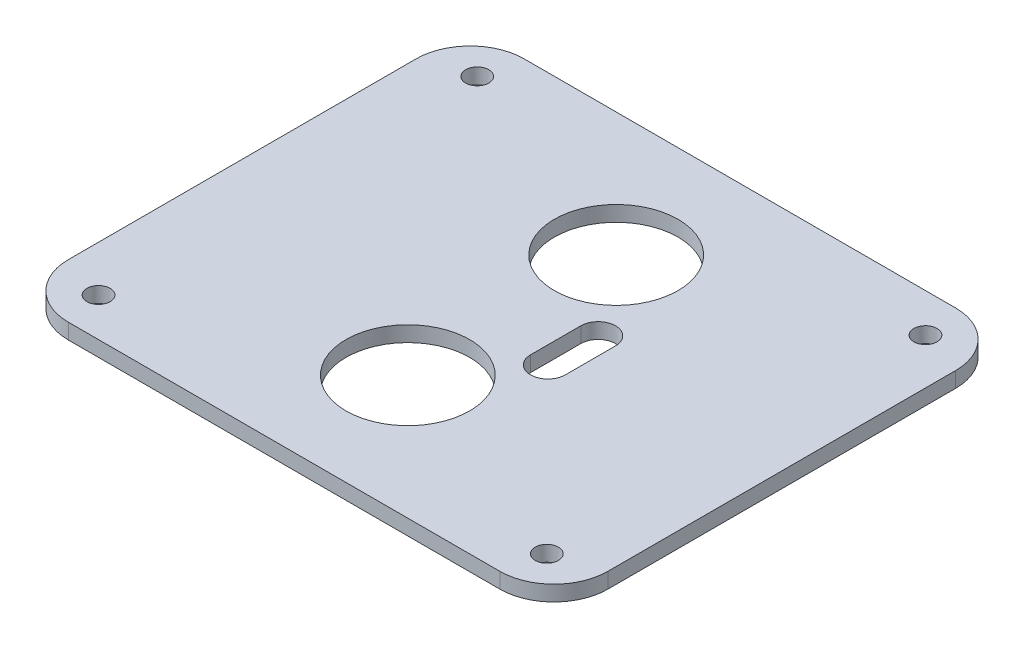
ISO-10303-21;
HEADER;
FILE_DESCRIPTION(('STEP AP214'),'2;1');
FILE_NAME('part.step','',(''),(''),'','','');
FILE_SCHEMA(('AUTOMOTIVE_DESIGN { 1 0 10303 214 1 1 1 1 }'));
ENDSEC;
DATA;
#1=APPLICATION_CONTEXT('core data for automotive mechanical design processes');
#2=APPLICATION_PROTOCOL_DEFINITION('international standard','automotive_design',2000,#1);
#3=PRODUCT_CONTEXT('',#1,'mechanical');
#4=PRODUCT('Part','Part','',(#3));
#5=PRODUCT_RELATED_PRODUCT_CATEGORY('part','',(#4));
#6=PRODUCT_DEFINITION_FORMATION('','',#4);
#7=PRODUCT_DEFINITION_CONTEXT('part definition',#1,'design');
#8=PRODUCT_DEFINITION('design','',#6,#7);
#9=PRODUCT_DEFINITION_SHAPE('','',#8);
#10=(LENGTH_UNIT() NAMED_UNIT(*) SI_UNIT(.MILLI.,.METRE.));
#11=(NAMED_UNIT(*) PLANE_ANGLE_UNIT() SI_UNIT($,.RADIAN.));
#12=(NAMED_UNIT(*) SI_UNIT($,.STERADIAN.) SOLID_ANGLE_UNIT());
#13=UNCERTAINTY_MEASURE_WITH_UNIT(LENGTH_MEASURE(1.E-05),#10,'distance_accuracy_value','');
#14=(GEOMETRIC_REPRESENTATION_CONTEXT(3) GLOBAL_UNCERTAINTY_ASSIGNED_CONTEXT((#13)) GLOBAL_UNIT_ASSIGNED_CONTEXT((#10,
#11,#12)) REPRESENTATION_CONTEXT('',''));
#15=CARTESIAN_POINT('',(0.,0.,0.));
#16=DIRECTION('',(0.,0.,1.));
#17=DIRECTION('',(1.,0.,0.));
#18=AXIS2_PLACEMENT_3D('',#15,#16,#17);
#19=CARTESIAN_POINT('',(0.,2.,0.));
#20=DIRECTION('',(0.,-1.,0.));
#21=DIRECTION('',(0.,0.,-1.));
#22=AXIS2_PLACEMENT_3D('',#19,#20,#21);
#23=PLANE('',#22);
#24=CARTESIAN_POINT('',(0.,2.,-13.48));
#25=DIRECTION('',(0.,1.,0.));
#26=DIRECTION('',(0.,0.,-1.));
#27=AXIS2_PLACEMENT_3D('',#24,#25,#26);
#28=CIRCLE('',#27,8.);
#29=CARTESIAN_POINT('',(0.,2.,-21.48));
#30=VERTEX_POINT('',#29);
#31=EDGE_CURVE('E166',#30,#30,#28,.T.);
#32=ORIENTED_EDGE('',*,*,#31,.F.);
#33=EDGE_LOOP('',(#32));
#34=FACE_BOUND('',#33,.T.);
#35=CARTESIAN_POINT('',(0.,2.,13.48));
#36=DIRECTION('',(0.,1.,0.));
#37=DIRECTION('',(0.,0.,1.));
#38=AXIS2_PLACEMENT_3D('',#35,#36,#37);
#39=CIRCLE('',#38,8.);
#40=CARTESIAN_POINT('',(0.,2.,21.48));
#41=VERTEX_POINT('',#40);
#42=EDGE_CURVE('E172',#41,#41,#39,.T.);
#43=ORIENTED_EDGE('',*,*,#42,.F.);
#44=EDGE_LOOP('',(#43));
#45=FACE_BOUND('',#44,.T.);
#46=CARTESIAN_POINT('',(-29.,2.,24.5));
#47=DIRECTION('',(0.,1.,0.));
#48=DIRECTION('',(0.,0.,1.));
#49=AXIS2_PLACEMENT_3D('',#46,#47,#48);
#50=CIRCLE('',#49,1.5);
#51=CARTESIAN_POINT('',(-29.,2.,26.));
#52=VERTEX_POINT('',#51);
#53=EDGE_CURVE('E178',#52,#52,#50,.T.);
#54=ORIENTED_EDGE('',*,*,#53,.F.);
#55=EDGE_LOOP('',(#54));
#56=FACE_BOUND('',#55,.T.);
#57=CARTESIAN_POINT('',(29.,2.,-24.5));
#58=DIRECTION('',(0.,1.,0.));
#59=DIRECTION('',(0.,0.,1.));
#60=AXIS2_PLACEMENT_3D('',#57,#58,#59);
#61=CIRCLE('',#60,1.5);
#62=CARTESIAN_POINT('',(29.,2.,-23.));
#63=VERTEX_POINT('',#62);
#64=EDGE_CURVE('E184',#63,#63,#61,.T.);
#65=ORIENTED_EDGE('',*,*,#64,.F.);
#66=EDGE_LOOP('',(#65));
#67=FACE_BOUND('',#66,.T.);
#68=CARTESIAN_POINT('',(29.,2.,24.5));
#69=DIRECTION('',(0.,1.,0.));
#70=DIRECTION('',(0.,0.,-1.));
#71=AXIS2_PLACEMENT_3D('',#68,#69,#70);
#72=CIRCLE('',#71,1.5);
#73=CARTESIAN_POINT('',(29.,2.,23.));
#74=VERTEX_POINT('',#73);
#75=EDGE_CURVE('E190',#74,#74,#72,.T.);
#76=ORIENTED_EDGE('',*,*,#75,.F.);
#77=EDGE_LOOP('',(#76));
#78=FACE_BOUND('',#77,.T.);
#79=CARTESIAN_POINT('',(-29.,2.,-24.5));
#80=DIRECTION('',(0.,1.,0.));
#81=DIRECTION('',(0.,0.,-1.));
#82=AXIS2_PLACEMENT_3D('',#79,#80,#81);
#83=CIRCLE('',#82,1.5);
#84=CARTESIAN_POINT('',(-29.,2.,-26.));
#85=VERTEX_POINT('',#84);
#86=EDGE_CURVE('E196',#85,#85,#83,.T.);
#87=ORIENTED_EDGE('',*,*,#86,.F.);
#88=EDGE_LOOP('',(#87));
#89=FACE_BOUND('',#88,.T.);
#90=DIRECTION('',(0.,0.,1.));
#91=VECTOR('',#90,1.);
#92=CARTESIAN_POINT('',(-34.9183673469388,2.,-29.5));
#93=LINE('',#92,#91);
#94=CARTESIAN_POINT('',(-34.9183673469388,2.,-22.5));
#95=VERTEX_POINT('',#94);
#96=CARTESIAN_POINT('',(-34.9183673469388,2.,22.5));
#97=VERTEX_POINT('',#96);
#98=EDGE_CURVE('E202',#95,#97,#93,.T.);
#99=ORIENTED_EDGE('',*,*,#98,.T.);
#100=CARTESIAN_POINT('',(-27.9183673469388,2.,22.5));
#101=DIRECTION('',(0.,-1.,0.));
#102=DIRECTION('',(0.,0.,-1.));
#103=AXIS2_PLACEMENT_3D('',#100,#101,#102);
#104=CIRCLE('',#103,7.00000000000001);
#105=CARTESIAN_POINT('',(-27.9183673469388,2.,29.5));
#106=VERTEX_POINT('',#105);
#107=EDGE_CURVE('E245',#97,#106,#104,.F.);
#108=ORIENTED_EDGE('',*,*,#107,.T.);
#109=DIRECTION('',(1.,0.,0.));
#110=VECTOR('',#109,1.);
#111=CARTESIAN_POINT('',(34.9183673469388,2.,29.5));
#112=LINE('',#111,#110);
#113=CARTESIAN_POINT('',(27.9183673469388,2.,29.5));
#114=VERTEX_POINT('',#113);
#115=EDGE_CURVE('E205',#106,#114,#112,.T.);
#116=ORIENTED_EDGE('',*,*,#115,.T.);
#117=CARTESIAN_POINT('',(27.9183673469388,2.,22.5));
#118=DIRECTION('',(0.,-1.,0.));
#119=DIRECTION('',(0.,0.,-1.));
#120=AXIS2_PLACEMENT_3D('',#117,#118,#119);
#121=CIRCLE('',#120,7.00000000000001);
#122=CARTESIAN_POINT('',(34.9183673469388,2.,22.5));
#123=VERTEX_POINT('',#122);
#124=EDGE_CURVE('E240',#114,#123,#121,.F.);
#125=ORIENTED_EDGE('',*,*,#124,.T.);
#126=DIRECTION('',(0.,0.,-1.));
#127=VECTOR('',#126,1.);
#128=CARTESIAN_POINT('',(34.9183673469388,2.,-29.5));
#129=LINE('',#128,#127);
#130=CARTESIAN_POINT('',(34.9183673469388,2.,-22.5));
#131=VERTEX_POINT('',#130);
#132=EDGE_CURVE('E209',#123,#131,#129,.T.);
#133=ORIENTED_EDGE('',*,*,#132,.T.);
#134=CARTESIAN_POINT('',(27.9183673469388,2.,-22.5));
#135=DIRECTION('',(0.,-1.,0.));
#136=DIRECTION('',(0.,0.,-1.));
#137=AXIS2_PLACEMENT_3D('',#134,#135,#136);
#138=CIRCLE('',#137,7.00000000000001);
#139=CARTESIAN_POINT('',(27.9183673469388,2.,-29.5));
#140=VERTEX_POINT('',#139);
#141=EDGE_CURVE('E56',#131,#140,#138,.F.);
#142=ORIENTED_EDGE('',*,*,#141,.T.);
#143=DIRECTION('',(-1.,0.,0.));
#144=VECTOR('',#143,1.);
#145=CARTESIAN_POINT('',(34.9183673469388,2.,-29.5));
#146=LINE('',#145,#144);
#147=CARTESIAN_POINT('',(-27.9183673469388,2.,-29.5));
#148=VERTEX_POINT('',#147);
#149=EDGE_CURVE('E211',#140,#148,#146,.T.);
#150=ORIENTED_EDGE('',*,*,#149,.T.);
#151=CARTESIAN_POINT('',(-27.9183673469388,2.,-22.5));
#152=DIRECTION('',(0.,-1.,0.));
#153=DIRECTION('',(0.,0.,-1.));
#154=AXIS2_PLACEMENT_3D('',#151,#152,#153);
#155=CIRCLE('',#154,7.00000000000001);
#156=EDGE_CURVE('E243',#148,#95,#155,.F.);
#157=ORIENTED_EDGE('',*,*,#156,.T.);
#158=EDGE_LOOP('',(#99,#108,#116,#125,#133,#142,#150,#157));
#159=FACE_BOUND('',#158,.T.);
#160=CARTESIAN_POINT('',(7.9,2.,3.25));
#161=DIRECTION('',(0.,1.,0.));
#162=DIRECTION('',(0.,0.,1.));
#163=AXIS2_PLACEMENT_3D('',#160,#161,#162);
#164=CIRCLE('',#163,2.25);
#165=CARTESIAN_POINT('',(5.65,2.,3.25));
#166=VERTEX_POINT('',#165);
#167=CARTESIAN_POINT('',(10.15,2.,3.25));
#168=VERTEX_POINT('',#167);
#169=EDGE_CURVE('E125',#166,#168,#164,.T.);
#170=ORIENTED_EDGE('',*,*,#169,.F.);
#171=DIRECTION('',(0.,0.,1.));
#172=VECTOR('',#171,1.);
#173=CARTESIAN_POINT('',(5.65,2.,3.25));
#174=LINE('',#173,#172);
#175=CARTESIAN_POINT('',(5.65,2.,-3.25));
#176=VERTEX_POINT('',#175);
#177=EDGE_CURVE('E150',#176,#166,#174,.T.);
#178=ORIENTED_EDGE('',*,*,#177,.F.);
#179=CARTESIAN_POINT('',(7.9,2.,-3.25));
#180=DIRECTION('',(0.,1.,0.));
#181=DIRECTION('',(0.,0.,1.));
#182=AXIS2_PLACEMENT_3D('',#179,#180,#181);
#183=CIRCLE('',#182,2.25);
#184=CARTESIAN_POINT('',(10.15,2.,-3.25));
#185=VERTEX_POINT('',#184);
#186=EDGE_CURVE('E148',#185,#176,#183,.T.);
#187=ORIENTED_EDGE('',*,*,#186,.F.);
#188=DIRECTION('',(0.,0.,-1.));
#189=VECTOR('',#188,1.);
#190=CARTESIAN_POINT('',(10.15,2.,3.25));
#191=LINE('',#190,#189);
#192=EDGE_CURVE('E135',#168,#185,#191,.T.);
#193=ORIENTED_EDGE('',*,*,#192,.F.);
#194=EDGE_LOOP('',(#170,#178,#187,#193));
#195=FACE_BOUND('',#194,.T.);
#196=ADVANCED_FACE('F34',(#34,#45,#56,#67,#78,#89,#159,#195),#23,.F.);
#197=CARTESIAN_POINT('',(0.,0.,0.));
#198=DIRECTION('',(0.,-1.,0.));
#199=DIRECTION('',(0.,0.,-1.));
#200=AXIS2_PLACEMENT_3D('',#197,#198,#199);
#201=PLANE('',#200);
#202=CARTESIAN_POINT('',(0.,0.,13.48));
#203=DIRECTION('',(0.,1.,0.));
#204=DIRECTION('',(0.,0.,1.));
#205=AXIS2_PLACEMENT_3D('',#202,#203,#204);
#206=CIRCLE('',#205,8.);
#207=CARTESIAN_POINT('',(0.,0.,21.48));
#208=VERTEX_POINT('',#207);
#209=EDGE_CURVE('E169',#208,#208,#206,.T.);
#210=ORIENTED_EDGE('',*,*,#209,.T.);
#211=EDGE_LOOP('',(#210));
#212=FACE_BOUND('',#211,.T.);
#213=CARTESIAN_POINT('',(29.,0.,-24.5));
#214=DIRECTION('',(0.,1.,0.));
#215=DIRECTION('',(0.,0.,1.));
#216=AXIS2_PLACEMENT_3D('',#213,#214,#215);
#217=CIRCLE('',#216,1.5);
#218=CARTESIAN_POINT('',(29.,0.,-23.));
#219=VERTEX_POINT('',#218);
#220=EDGE_CURVE('E181',#219,#219,#217,.T.);
#221=ORIENTED_EDGE('',*,*,#220,.T.);
#222=EDGE_LOOP('',(#221));
#223=FACE_BOUND('',#222,.T.);
#224=CARTESIAN_POINT('',(-29.,0.,-24.5));
#225=DIRECTION('',(0.,1.,0.));
#226=DIRECTION('',(0.,0.,-1.));
#227=AXIS2_PLACEMENT_3D('',#224,#225,#226);
#228=CIRCLE('',#227,1.5);
#229=CARTESIAN_POINT('',(-29.,0.,-26.));
#230=VERTEX_POINT('',#229);
#231=EDGE_CURVE('E193',#230,#230,#228,.T.);
#232=ORIENTED_EDGE('',*,*,#231,.T.);
#233=EDGE_LOOP('',(#232));
#234=FACE_BOUND('',#233,.T.);
#235=DIRECTION('',(1.,0.,0.));
#236=VECTOR('',#235,1.);
#237=CARTESIAN_POINT('',(34.9183673469388,0.,29.5));
#238=LINE('',#237,#236);
#239=CARTESIAN_POINT('',(-27.9183673469388,0.,29.5));
#240=VERTEX_POINT('',#239);
#241=CARTESIAN_POINT('',(27.9183673469388,0.,29.5));
#242=VERTEX_POINT('',#241);
#243=EDGE_CURVE('E216',#240,#242,#238,.T.);
#244=ORIENTED_EDGE('',*,*,#243,.F.);
#245=CARTESIAN_POINT('',(-27.9183673469388,0.,22.5));
#246=DIRECTION('',(0.,-1.,0.));
#247=DIRECTION('',(0.,0.,-1.));
#248=AXIS2_PLACEMENT_3D('',#245,#246,#247);
#249=CIRCLE('',#248,7.00000000000001);
#250=CARTESIAN_POINT('',(-34.9183673469388,0.,22.5));
#251=VERTEX_POINT('',#250);
#252=EDGE_CURVE('E233',#240,#251,#249,.T.);
#253=ORIENTED_EDGE('',*,*,#252,.T.);
#254=DIRECTION('',(0.,0.,1.));
#255=VECTOR('',#254,1.);
#256=CARTESIAN_POINT('',(-34.9183673469388,0.,-29.5));
#257=LINE('',#256,#255);
#258=CARTESIAN_POINT('',(-34.9183673469388,0.,-22.5));
#259=VERTEX_POINT('',#258);
#260=EDGE_CURVE('E199',#259,#251,#257,.T.);
#261=ORIENTED_EDGE('',*,*,#260,.F.);
#262=CARTESIAN_POINT('',(-27.9183673469388,0.,-22.5));
#263=DIRECTION('',(0.,-1.,0.));
#264=DIRECTION('',(0.,0.,-1.));
#265=AXIS2_PLACEMENT_3D('',#262,#263,#264);
#266=CIRCLE('',#265,7.00000000000001);
#267=CARTESIAN_POINT('',(-27.9183673469388,0.,-29.5));
#268=VERTEX_POINT('',#267);
#269=EDGE_CURVE('E231',#259,#268,#266,.T.);
#270=ORIENTED_EDGE('',*,*,#269,.T.);
#271=DIRECTION('',(-1.,0.,0.));
#272=VECTOR('',#271,1.);
#273=CARTESIAN_POINT('',(34.9183673469388,0.,-29.5));
#274=LINE('',#273,#272);
#275=CARTESIAN_POINT('',(27.9183673469388,0.,-29.5));
#276=VERTEX_POINT('',#275);
#277=EDGE_CURVE('E206',#276,#268,#274,.T.);
#278=ORIENTED_EDGE('',*,*,#277,.F.);
#279=CARTESIAN_POINT('',(27.9183673469388,0.,-22.5));
#280=DIRECTION('',(0.,-1.,0.));
#281=DIRECTION('',(0.,0.,-1.));
#282=AXIS2_PLACEMENT_3D('',#279,#280,#281);
#283=CIRCLE('',#282,7.00000000000001);
#284=CARTESIAN_POINT('',(34.9183673469388,0.,-22.5));
#285=VERTEX_POINT('',#284);
#286=EDGE_CURVE('E229',#276,#285,#283,.T.);
#287=ORIENTED_EDGE('',*,*,#286,.T.);
#288=DIRECTION('',(0.,0.,-1.));
#289=VECTOR('',#288,1.);
#290=CARTESIAN_POINT('',(34.9183673469388,0.,-29.5));
#291=LINE('',#290,#289);
#292=CARTESIAN_POINT('',(34.9183673469388,0.,22.5));
#293=VERTEX_POINT('',#292);
#294=EDGE_CURVE('E219',#293,#285,#291,.T.);
#295=ORIENTED_EDGE('',*,*,#294,.F.);
#296=CARTESIAN_POINT('',(27.9183673469388,0.,22.5));
#297=DIRECTION('',(0.,-1.,0.));
#298=DIRECTION('',(0.,0.,-1.));
#299=AXIS2_PLACEMENT_3D('',#296,#297,#298);
#300=CIRCLE('',#299,7.00000000000001);
#301=EDGE_CURVE('E227',#293,#242,#300,.T.);
#302=ORIENTED_EDGE('',*,*,#301,.T.);
#303=EDGE_LOOP('',(#244,#253,#261,#270,#278,#287,#295,#302));
#304=FACE_BOUND('',#303,.T.);
#305=CARTESIAN_POINT('',(29.,0.,24.5));
#306=DIRECTION('',(0.,1.,0.));
#307=DIRECTION('',(0.,0.,-1.));
#308=AXIS2_PLACEMENT_3D('',#305,#306,#307);
#309=CIRCLE('',#308,1.5);
#310=CARTESIAN_POINT('',(29.,0.,23.));
#311=VERTEX_POINT('',#310);
#312=EDGE_CURVE('E187',#311,#311,#309,.T.);
#313=ORIENTED_EDGE('',*,*,#312,.T.);
#314=EDGE_LOOP('',(#313));
#315=FACE_BOUND('',#314,.T.);
#316=CARTESIAN_POINT('',(-29.,0.,24.5));
#317=DIRECTION('',(0.,1.,0.));
#318=DIRECTION('',(0.,0.,1.));
#319=AXIS2_PLACEMENT_3D('',#316,#317,#318);
#320=CIRCLE('',#319,1.5);
#321=CARTESIAN_POINT('',(-29.,0.,26.));
#322=VERTEX_POINT('',#321);
#323=EDGE_CURVE('E175',#322,#322,#320,.T.);
#324=ORIENTED_EDGE('',*,*,#323,.T.);
#325=EDGE_LOOP('',(#324));
#326=FACE_BOUND('',#325,.T.);
#327=CARTESIAN_POINT('',(0.,0.,-13.48));
#328=DIRECTION('',(0.,1.,0.));
#329=DIRECTION('',(0.,0.,-1.));
#330=AXIS2_PLACEMENT_3D('',#327,#328,#329);
#331=CIRCLE('',#330,8.);
#332=CARTESIAN_POINT('',(0.,0.,-21.48));
#333=VERTEX_POINT('',#332);
#334=EDGE_CURVE('E143',#333,#333,#331,.T.);
#335=ORIENTED_EDGE('',*,*,#334,.T.);
#336=EDGE_LOOP('',(#335));
#337=FACE_BOUND('',#336,.T.);
#338=DIRECTION('',(0.,0.,1.));
#339=VECTOR('',#338,1.);
#340=CARTESIAN_POINT('',(5.65,0.,3.25));
#341=LINE('',#340,#339);
#342=CARTESIAN_POINT('',(5.65,0.,-3.25));
#343=VERTEX_POINT('',#342);
#344=CARTESIAN_POINT('',(5.65,0.,3.25));
#345=VERTEX_POINT('',#344);
#346=EDGE_CURVE('E136',#343,#345,#341,.T.);
#347=ORIENTED_EDGE('',*,*,#346,.T.);
#348=CARTESIAN_POINT('',(7.9,0.,3.25));
#349=DIRECTION('',(0.,1.,0.));
#350=DIRECTION('',(0.,0.,1.));
#351=AXIS2_PLACEMENT_3D('',#348,#349,#350);
#352=CIRCLE('',#351,2.25);
#353=CARTESIAN_POINT('',(10.15,0.,3.25));
#354=VERTEX_POINT('',#353);
#355=EDGE_CURVE('E154',#345,#354,#352,.T.);
#356=ORIENTED_EDGE('',*,*,#355,.T.);
#357=DIRECTION('',(0.,0.,-1.));
#358=VECTOR('',#357,1.);
#359=CARTESIAN_POINT('',(10.15,0.,3.25));
#360=LINE('',#359,#358);
#361=CARTESIAN_POINT('',(10.15,0.,-3.25));
#362=VERTEX_POINT('',#361);
#363=EDGE_CURVE('E142',#354,#362,#360,.T.);
#364=ORIENTED_EDGE('',*,*,#363,.T.);
#365=CARTESIAN_POINT('',(7.9,0.,-3.25));
#366=DIRECTION('',(0.,1.,0.));
#367=DIRECTION('',(0.,0.,1.));
#368=AXIS2_PLACEMENT_3D('',#365,#366,#367);
#369=CIRCLE('',#368,2.25);
#370=EDGE_CURVE('E157',#362,#343,#369,.T.);
#371=ORIENTED_EDGE('',*,*,#370,.T.);
#372=EDGE_LOOP('',(#347,#356,#364,#371));
#373=FACE_BOUND('',#372,.T.);
#374=ADVANCED_FACE('F261',(#212,#223,#234,#304,#315,#326,#337,#373),#201,.T.);
#375=CARTESIAN_POINT('',(-34.9183673469388,2.,-29.5));
#376=DIRECTION('',(1.,0.,0.));
#377=DIRECTION('',(0.,0.,-1.));
#378=AXIS2_PLACEMENT_3D('',#375,#376,#377);
#379=PLANE('',#378);
#380=ORIENTED_EDGE('',*,*,#260,.T.);
#381=DIRECTION('',(0.,-1.,0.));
#382=VECTOR('',#381,1.);
#383=CARTESIAN_POINT('',(-34.9183673469388,2.,22.5));
#384=LINE('',#383,#382);
#385=EDGE_CURVE('E238',#251,#97,#384,.F.);
#386=ORIENTED_EDGE('',*,*,#385,.T.);
#387=ORIENTED_EDGE('',*,*,#98,.F.);
#388=DIRECTION('',(0.,-1.,0.));
#389=VECTOR('',#388,1.);
#390=CARTESIAN_POINT('',(-34.9183673469388,2.,-22.5));
#391=LINE('',#390,#389);
#392=EDGE_CURVE('E235',#95,#259,#391,.T.);
#393=ORIENTED_EDGE('',*,*,#392,.T.);
#394=EDGE_LOOP('',(#380,#386,#387,#393));
#395=FACE_BOUND('',#394,.T.);
#396=ADVANCED_FACE('F275',(#395),#379,.F.);
#397=CARTESIAN_POINT('',(34.9183673469388,2.,29.5));
#398=DIRECTION('',(0.,0.,-1.));
#399=DIRECTION('',(-1.,0.,0.));
#400=AXIS2_PLACEMENT_3D('',#397,#398,#399);
#401=PLANE('',#400);
#402=ORIENTED_EDGE('',*,*,#115,.F.);
#403=DIRECTION('',(0.,-1.,0.));
#404=VECTOR('',#403,1.);
#405=CARTESIAN_POINT('',(-27.9183673469388,2.,29.5));
#406=LINE('',#405,#404);
#407=EDGE_CURVE('E224',#106,#240,#406,.T.);
#408=ORIENTED_EDGE('',*,*,#407,.T.);
#409=ORIENTED_EDGE('',*,*,#243,.T.);
#410=DIRECTION('',(0.,-1.,0.));
#411=VECTOR('',#410,1.);
#412=CARTESIAN_POINT('',(27.9183673469388,2.,29.5));
#413=LINE('',#412,#411);
#414=EDGE_CURVE('E213',#242,#114,#413,.F.);
#415=ORIENTED_EDGE('',*,*,#414,.T.);
#416=EDGE_LOOP('',(#402,#408,#409,#415));
#417=FACE_BOUND('',#416,.T.);
#418=ADVANCED_FACE('F283',(#417),#401,.F.);
#419=CARTESIAN_POINT('',(34.9183673469388,2.,-29.5));
#420=DIRECTION('',(-1.,0.,0.));
#421=DIRECTION('',(0.,0.,1.));
#422=AXIS2_PLACEMENT_3D('',#419,#420,#421);
#423=PLANE('',#422);
#424=ORIENTED_EDGE('',*,*,#294,.T.);
#425=DIRECTION('',(0.,-1.,0.));
#426=VECTOR('',#425,1.);
#427=CARTESIAN_POINT('',(34.9183673469388,2.,-22.5));
#428=LINE('',#427,#426);
#429=EDGE_CURVE('E11',#285,#131,#428,.F.);
#430=ORIENTED_EDGE('',*,*,#429,.T.);
#431=ORIENTED_EDGE('',*,*,#132,.F.);
#432=DIRECTION('',(0.,-1.,0.));
#433=VECTOR('',#432,1.);
#434=CARTESIAN_POINT('',(34.9183673469388,2.,22.5));
#435=LINE('',#434,#433);
#436=EDGE_CURVE('E42',#123,#293,#435,.T.);
#437=ORIENTED_EDGE('',*,*,#436,.T.);
#438=EDGE_LOOP('',(#424,#430,#431,#437));
#439=FACE_BOUND('',#438,.T.);
#440=ADVANCED_FACE('F255',(#439),#423,.F.);
#441=CARTESIAN_POINT('',(34.9183673469388,2.,-29.5));
#442=DIRECTION('',(0.,0.,1.));
#443=DIRECTION('',(1.,0.,0.));
#444=AXIS2_PLACEMENT_3D('',#441,#442,#443);
#445=PLANE('',#444);
#446=ORIENTED_EDGE('',*,*,#277,.T.);
#447=DIRECTION('',(0.,-1.,0.));
#448=VECTOR('',#447,1.);
#449=CARTESIAN_POINT('',(-27.9183673469388,2.,-29.5));
#450=LINE('',#449,#448);
#451=EDGE_CURVE('E49',#268,#148,#450,.F.);
#452=ORIENTED_EDGE('',*,*,#451,.T.);
#453=ORIENTED_EDGE('',*,*,#149,.F.);
#454=DIRECTION('',(0.,-1.,0.));
#455=VECTOR('',#454,1.);
#456=CARTESIAN_POINT('',(27.9183673469388,2.,-29.5));
#457=LINE('',#456,#455);
#458=EDGE_CURVE('E247',#140,#276,#457,.T.);
#459=ORIENTED_EDGE('',*,*,#458,.T.);
#460=EDGE_LOOP('',(#446,#452,#453,#459));
#461=FACE_BOUND('',#460,.T.);
#462=ADVANCED_FACE('F267',(#461),#445,.F.);
#463=CARTESIAN_POINT('',(-29.,2.,-24.5));
#464=DIRECTION('',(0.,-1.,0.));
#465=DIRECTION('',(0.,0.,-1.));
#466=AXIS2_PLACEMENT_3D('',#463,#464,#465);
#467=CYLINDRICAL_SURFACE('',#466,1.5);
#468=ORIENTED_EDGE('',*,*,#86,.T.);
#469=EDGE_LOOP('',(#468));
#470=FACE_BOUND('',#469,.T.);
#471=ORIENTED_EDGE('',*,*,#231,.F.);
#472=EDGE_LOOP('',(#471));
#473=FACE_BOUND('',#472,.T.);
#474=ADVANCED_FACE('F300',(#470,#473),#467,.F.);
#475=CARTESIAN_POINT('',(29.,2.,24.5));
#476=DIRECTION('',(0.,-1.,0.));
#477=DIRECTION('',(0.,0.,-1.));
#478=AXIS2_PLACEMENT_3D('',#475,#476,#477);
#479=CYLINDRICAL_SURFACE('',#478,1.5);
#480=ORIENTED_EDGE('',*,*,#75,.T.);
#481=EDGE_LOOP('',(#480));
#482=FACE_BOUND('',#481,.T.);
#483=ORIENTED_EDGE('',*,*,#312,.F.);
#484=EDGE_LOOP('',(#483));
#485=FACE_BOUND('',#484,.T.);
#486=ADVANCED_FACE('F403',(#482,#485),#479,.F.);
#487=CARTESIAN_POINT('',(29.,2.,-24.5));
#488=DIRECTION('',(0.,-1.,0.));
#489=DIRECTION('',(0.,0.,-1.));
#490=AXIS2_PLACEMENT_3D('',#487,#488,#489);
#491=CYLINDRICAL_SURFACE('',#490,1.5);
#492=ORIENTED_EDGE('',*,*,#64,.T.);
#493=EDGE_LOOP('',(#492));
#494=FACE_BOUND('',#493,.T.);
#495=ORIENTED_EDGE('',*,*,#220,.F.);
#496=EDGE_LOOP('',(#495));
#497=FACE_BOUND('',#496,.T.);
#498=ADVANCED_FACE('F394',(#494,#497),#491,.F.);
#499=CARTESIAN_POINT('',(-29.,2.,24.5));
#500=DIRECTION('',(0.,-1.,0.));
#501=DIRECTION('',(0.,0.,-1.));
#502=AXIS2_PLACEMENT_3D('',#499,#500,#501);
#503=CYLINDRICAL_SURFACE('',#502,1.5);
#504=ORIENTED_EDGE('',*,*,#53,.T.);
#505=EDGE_LOOP('',(#504));
#506=FACE_BOUND('',#505,.T.);
#507=ORIENTED_EDGE('',*,*,#323,.F.);
#508=EDGE_LOOP('',(#507));
#509=FACE_BOUND('',#508,.T.);
#510=ADVANCED_FACE('F385',(#506,#509),#503,.F.);
#511=CARTESIAN_POINT('',(0.,2.,13.48));
#512=DIRECTION('',(0.,-1.,0.));
#513=DIRECTION('',(0.,0.,-1.));
#514=AXIS2_PLACEMENT_3D('',#511,#512,#513);
#515=CYLINDRICAL_SURFACE('',#514,8.);
#516=ORIENTED_EDGE('',*,*,#42,.T.);
#517=EDGE_LOOP('',(#516));
#518=FACE_BOUND('',#517,.T.);
#519=ORIENTED_EDGE('',*,*,#209,.F.);
#520=EDGE_LOOP('',(#519));
#521=FACE_BOUND('',#520,.T.);
#522=ADVANCED_FACE('F376',(#518,#521),#515,.F.);
#523=CARTESIAN_POINT('',(0.,2.,-13.48));
#524=DIRECTION('',(0.,-1.,0.));
#525=DIRECTION('',(0.,0.,-1.));
#526=AXIS2_PLACEMENT_3D('',#523,#524,#525);
#527=CYLINDRICAL_SURFACE('',#526,8.);
#528=ORIENTED_EDGE('',*,*,#31,.T.);
#529=EDGE_LOOP('',(#528));
#530=FACE_BOUND('',#529,.T.);
#531=ORIENTED_EDGE('',*,*,#334,.F.);
#532=EDGE_LOOP('',(#531));
#533=FACE_BOUND('',#532,.T.);
#534=ADVANCED_FACE('F368',(#530,#533),#527,.F.);
#535=CARTESIAN_POINT('',(7.9,2.,3.25));
#536=DIRECTION('',(0.,-1.,0.));
#537=DIRECTION('',(0.,0.,-1.));
#538=AXIS2_PLACEMENT_3D('',#535,#536,#537);
#539=CYLINDRICAL_SURFACE('',#538,2.25);
#540=ORIENTED_EDGE('',*,*,#355,.F.);
#541=DIRECTION('',(0.,-1.,0.));
#542=VECTOR('',#541,1.);
#543=CARTESIAN_POINT('',(5.65,2.,3.25));
#544=LINE('',#543,#542);
#545=EDGE_CURVE('E131',#166,#345,#544,.T.);
#546=ORIENTED_EDGE('',*,*,#545,.F.);
#547=ORIENTED_EDGE('',*,*,#169,.T.);
#548=DIRECTION('',(0.,-1.,0.));
#549=VECTOR('',#548,1.);
#550=CARTESIAN_POINT('',(10.15,2.,3.25));
#551=LINE('',#550,#549);
#552=EDGE_CURVE('E128',#168,#354,#551,.T.);
#553=ORIENTED_EDGE('',*,*,#552,.T.);
#554=EDGE_LOOP('',(#540,#546,#547,#553));
#555=FACE_BOUND('',#554,.T.);
#556=ADVANCED_FACE('F127',(#555),#539,.F.);
#557=CARTESIAN_POINT('',(10.15,2.,3.25));
#558=DIRECTION('',(-1.,0.,0.));
#559=DIRECTION('',(0.,0.,1.));
#560=AXIS2_PLACEMENT_3D('',#557,#558,#559);
#561=PLANE('',#560);
#562=ORIENTED_EDGE('',*,*,#363,.F.);
#563=ORIENTED_EDGE('',*,*,#552,.F.);
#564=ORIENTED_EDGE('',*,*,#192,.T.);
#565=DIRECTION('',(0.,-1.,0.));
#566=VECTOR('',#565,1.);
#567=CARTESIAN_POINT('',(10.15,2.,-3.25));
#568=LINE('',#567,#566);
#569=EDGE_CURVE('E144',#185,#362,#568,.T.);
#570=ORIENTED_EDGE('',*,*,#569,.T.);
#571=EDGE_LOOP('',(#562,#563,#564,#570));
#572=FACE_BOUND('',#571,.T.);
#573=ADVANCED_FACE('F139',(#572),#561,.T.);
#574=CARTESIAN_POINT('',(7.9,2.,-3.25));
#575=DIRECTION('',(0.,-1.,0.));
#576=DIRECTION('',(0.,0.,-1.));
#577=AXIS2_PLACEMENT_3D('',#574,#575,#576);
#578=CYLINDRICAL_SURFACE('',#577,2.25);
#579=ORIENTED_EDGE('',*,*,#370,.F.);
#580=ORIENTED_EDGE('',*,*,#569,.F.);
#581=ORIENTED_EDGE('',*,*,#186,.T.);
#582=DIRECTION('',(0.,-1.,0.));
#583=VECTOR('',#582,1.);
#584=CARTESIAN_POINT('',(5.65,2.,-3.25));
#585=LINE('',#584,#583);
#586=EDGE_CURVE('E163',#176,#343,#585,.T.);
#587=ORIENTED_EDGE('',*,*,#586,.T.);
#588=EDGE_LOOP('',(#579,#580,#581,#587));
#589=FACE_BOUND('',#588,.T.);
#590=ADVANCED_FACE('F344',(#589),#578,.F.);
#591=CARTESIAN_POINT('',(5.65,2.,3.25));
#592=DIRECTION('',(1.,0.,0.));
#593=DIRECTION('',(0.,0.,-1.));
#594=AXIS2_PLACEMENT_3D('',#591,#592,#593);
#595=PLANE('',#594);
#596=ORIENTED_EDGE('',*,*,#346,.F.);
#597=ORIENTED_EDGE('',*,*,#586,.F.);
#598=ORIENTED_EDGE('',*,*,#177,.T.);
#599=ORIENTED_EDGE('',*,*,#545,.T.);
#600=EDGE_LOOP('',(#596,#597,#598,#599));
#601=FACE_BOUND('',#600,.T.);
#602=ADVANCED_FACE('F313',(#601),#595,.T.);
#603=CARTESIAN_POINT('',(-27.9183673469388,2.,22.5));
#604=DIRECTION('',(0.,-1.,0.));
#605=DIRECTION('',(0.,0.,-1.));
#606=AXIS2_PLACEMENT_3D('',#603,#604,#605);
#607=CYLINDRICAL_SURFACE('',#606,7.00000000000001);
#608=ORIENTED_EDGE('',*,*,#107,.F.);
#609=ORIENTED_EDGE('',*,*,#385,.F.);
#610=ORIENTED_EDGE('',*,*,#252,.F.);
#611=ORIENTED_EDGE('',*,*,#407,.F.);
#612=EDGE_LOOP('',(#608,#609,#610,#611));
#613=FACE_BOUND('',#612,.T.);
#614=ADVANCED_FACE('F280',(#613),#607,.T.);
#615=CARTESIAN_POINT('',(-27.9183673469388,2.,-22.5));
#616=DIRECTION('',(0.,-1.,0.));
#617=DIRECTION('',(0.,0.,-1.));
#618=AXIS2_PLACEMENT_3D('',#615,#616,#617);
#619=CYLINDRICAL_SURFACE('',#618,7.00000000000001);
#620=ORIENTED_EDGE('',*,*,#156,.F.);
#621=ORIENTED_EDGE('',*,*,#451,.F.);
#622=ORIENTED_EDGE('',*,*,#269,.F.);
#623=ORIENTED_EDGE('',*,*,#392,.F.);
#624=EDGE_LOOP('',(#620,#621,#622,#623));
#625=FACE_BOUND('',#624,.T.);
#626=ADVANCED_FACE('F272',(#625),#619,.T.);
#627=CARTESIAN_POINT('',(27.9183673469388,2.,-22.5));
#628=DIRECTION('',(0.,-1.,0.));
#629=DIRECTION('',(0.,0.,-1.));
#630=AXIS2_PLACEMENT_3D('',#627,#628,#629);
#631=CYLINDRICAL_SURFACE('',#630,7.00000000000001);
#632=ORIENTED_EDGE('',*,*,#141,.F.);
#633=ORIENTED_EDGE('',*,*,#429,.F.);
#634=ORIENTED_EDGE('',*,*,#286,.F.);
#635=ORIENTED_EDGE('',*,*,#458,.F.);
#636=EDGE_LOOP('',(#632,#633,#634,#635));
#637=FACE_BOUND('',#636,.T.);
#638=ADVANCED_FACE('F266',(#637),#631,.T.);
#639=CARTESIAN_POINT('',(27.9183673469388,2.,22.5));
#640=DIRECTION('',(0.,-1.,0.));
#641=DIRECTION('',(0.,0.,-1.));
#642=AXIS2_PLACEMENT_3D('',#639,#640,#641);
#643=CYLINDRICAL_SURFACE('',#642,7.00000000000001);
#644=ORIENTED_EDGE('',*,*,#124,.F.);
#645=ORIENTED_EDGE('',*,*,#414,.F.);
#646=ORIENTED_EDGE('',*,*,#301,.F.);
#647=ORIENTED_EDGE('',*,*,#436,.F.);
#648=EDGE_LOOP('',(#644,#645,#646,#647));
#649=FACE_BOUND('',#648,.T.);
#650=ADVANCED_FACE('F36',(#649),#643,.T.);
#651=CLOSED_SHELL('',(#196,#374,#396,#418,#440,#462,#474,#486,#498,#510,#522,#534,#556,#573,
#590,#602,#614,#626,#638,#650));
#652=MANIFOLD_SOLID_BREP('B2',#651);
#653=ADVANCED_BREP_SHAPE_REPRESENTATION('',(#18,#652),#14);
#654=SHAPE_DEFINITION_REPRESENTATION(#9,#653);
ENDSEC;
END-ISO-10303-21;
